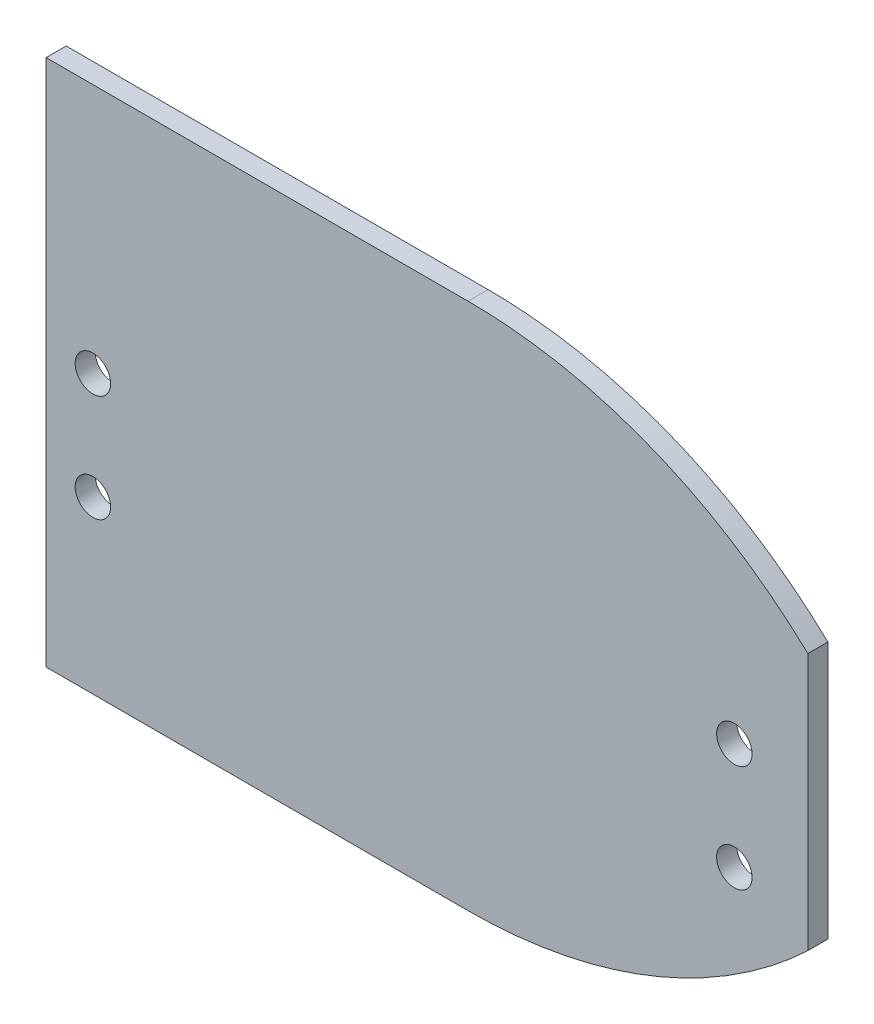
ISO-10303-21;
HEADER;
FILE_DESCRIPTION(('STEP AP214'),'2;1');
FILE_NAME('part.step','',(''),(''),'','','');
FILE_SCHEMA(('AUTOMOTIVE_DESIGN { 1 0 10303 214 1 1 1 1 }'));
ENDSEC;
DATA;
#1=APPLICATION_CONTEXT('core data for automotive mechanical design processes');
#2=APPLICATION_PROTOCOL_DEFINITION('international standard','automotive_design',2000,#1);
#3=PRODUCT_CONTEXT('',#1,'mechanical');
#4=PRODUCT('Part','Part','',(#3));
#5=PRODUCT_RELATED_PRODUCT_CATEGORY('part','',(#4));
#6=PRODUCT_DEFINITION_FORMATION('','',#4);
#7=PRODUCT_DEFINITION_CONTEXT('part definition',#1,'design');
#8=PRODUCT_DEFINITION('design','',#6,#7);
#9=PRODUCT_DEFINITION_SHAPE('','',#8);
#10=(LENGTH_UNIT() NAMED_UNIT(*) SI_UNIT(.MILLI.,.METRE.));
#11=(NAMED_UNIT(*) PLANE_ANGLE_UNIT() SI_UNIT($,.RADIAN.));
#12=(NAMED_UNIT(*) SI_UNIT($,.STERADIAN.) SOLID_ANGLE_UNIT());
#13=UNCERTAINTY_MEASURE_WITH_UNIT(LENGTH_MEASURE(1.E-05),#10,'distance_accuracy_value','');
#14=(GEOMETRIC_REPRESENTATION_CONTEXT(3) GLOBAL_UNCERTAINTY_ASSIGNED_CONTEXT((#13)) GLOBAL_UNIT_ASSIGNED_CONTEXT((#10,
#11,#12)) REPRESENTATION_CONTEXT('',''));
#15=CARTESIAN_POINT('',(0.,0.,0.));
#16=DIRECTION('',(0.,0.,1.));
#17=DIRECTION('',(1.,0.,0.));
#18=AXIS2_PLACEMENT_3D('',#15,#16,#17);
#19=CARTESIAN_POINT('',(223.609177450578,62.7062500000001,4.76250000000001));
#20=DIRECTION('',(0.,-1.,0.));
#21=DIRECTION('',(0.,0.,-1.));
#22=AXIS2_PLACEMENT_3D('',#19,#20,#21);
#23=PLANE('',#22);
#24=DIRECTION('',(-1.,0.,0.));
#25=VECTOR('',#24,1.);
#26=CARTESIAN_POINT('',(223.609177450578,62.7062500000001,0.));
#27=LINE('',#26,#25);
#28=CARTESIAN_POINT('',(323.85,62.7062500000001,0.));
#29=VERTEX_POINT('',#28);
#30=CARTESIAN_POINT('',(223.609177450578,62.7062500000001,0.));
#31=VERTEX_POINT('',#30);
#32=EDGE_CURVE('E94',#29,#31,#27,.T.);
#33=ORIENTED_EDGE('',*,*,#32,.T.);
#34=DIRECTION('',(0.,0.,-1.));
#35=VECTOR('',#34,1.);
#36=CARTESIAN_POINT('',(223.609177450578,62.7062500000001,4.76250000000001));
#37=LINE('',#36,#35);
#38=CARTESIAN_POINT('',(223.609177450578,62.7062500000001,4.76250000000001));
#39=VERTEX_POINT('',#38);
#40=EDGE_CURVE('E11',#39,#31,#37,.T.);
#41=ORIENTED_EDGE('',*,*,#40,.F.);
#42=DIRECTION('',(-1.,0.,0.));
#43=VECTOR('',#42,1.);
#44=CARTESIAN_POINT('',(223.609177450578,62.7062500000001,4.76250000000001));
#45=LINE('',#44,#43);
#46=CARTESIAN_POINT('',(323.85,62.7062500000001,4.76250000000001));
#47=VERTEX_POINT('',#46);
#48=EDGE_CURVE('E95',#47,#39,#45,.T.);
#49=ORIENTED_EDGE('',*,*,#48,.F.);
#50=DIRECTION('',(0.,0.,-1.));
#51=VECTOR('',#50,1.);
#52=CARTESIAN_POINT('',(323.85,62.7062500000001,4.76250000000001));
#53=LINE('',#52,#51);
#54=EDGE_CURVE('E125',#47,#29,#53,.T.);
#55=ORIENTED_EDGE('',*,*,#54,.T.);
#56=EDGE_LOOP('',(#33,#41,#49,#55));
#57=FACE_BOUND('',#56,.T.);
#58=ADVANCED_FACE('F24',(#57),#23,.F.);
#59=CARTESIAN_POINT('',(223.609177450578,62.7062500000001,4.76250000000001));
#60=DIRECTION('',(1.,0.,0.));
#61=DIRECTION('',(0.,1.,0.));
#62=AXIS2_PLACEMENT_3D('',#59,#60,#61);
#63=PLANE('',#62);
#64=DIRECTION('',(0.,-1.,0.));
#65=VECTOR('',#64,1.);
#66=CARTESIAN_POINT('',(223.609177450578,62.7062500000001,0.));
#67=LINE('',#66,#65);
#68=CARTESIAN_POINT('',(223.609177450578,-62.7062500000002,0.));
#69=VERTEX_POINT('',#68);
#70=EDGE_CURVE('E140',#31,#69,#67,.T.);
#71=ORIENTED_EDGE('',*,*,#70,.T.);
#72=DIRECTION('',(0.,0.,-1.));
#73=VECTOR('',#72,1.);
#74=CARTESIAN_POINT('',(223.609177450578,-62.7062500000002,4.76250000000001));
#75=LINE('',#74,#73);
#76=CARTESIAN_POINT('',(223.609177450578,-62.7062500000002,4.76250000000001));
#77=VERTEX_POINT('',#76);
#78=EDGE_CURVE('E31',#77,#69,#75,.T.);
#79=ORIENTED_EDGE('',*,*,#78,.F.);
#80=DIRECTION('',(0.,-1.,0.));
#81=VECTOR('',#80,1.);
#82=CARTESIAN_POINT('',(223.609177450578,62.7062500000001,4.76250000000001));
#83=LINE('',#82,#81);
#84=EDGE_CURVE('E98',#39,#77,#83,.T.);
#85=ORIENTED_EDGE('',*,*,#84,.F.);
#86=ORIENTED_EDGE('',*,*,#40,.T.);
#87=EDGE_LOOP('',(#71,#79,#85,#86));
#88=FACE_BOUND('',#87,.T.);
#89=ADVANCED_FACE('F175',(#88),#63,.F.);
#90=CARTESIAN_POINT('',(223.609177450578,-62.7062500000002,4.76250000000001));
#91=DIRECTION('',(0.,1.,0.));
#92=DIRECTION('',(-1.,0.,0.));
#93=AXIS2_PLACEMENT_3D('',#90,#91,#92);
#94=PLANE('',#93);
#95=DIRECTION('',(1.,0.,0.));
#96=VECTOR('',#95,1.);
#97=CARTESIAN_POINT('',(223.609177450578,-62.7062500000002,0.));
#98=LINE('',#97,#96);
#99=CARTESIAN_POINT('',(323.85,-62.7062500000002,0.));
#100=VERTEX_POINT('',#99);
#101=EDGE_CURVE('E100',#69,#100,#98,.T.);
#102=ORIENTED_EDGE('',*,*,#101,.T.);
#103=DIRECTION('',(0.,0.,-1.));
#104=VECTOR('',#103,1.);
#105=CARTESIAN_POINT('',(323.85,-62.7062500000002,4.76250000000001));
#106=LINE('',#105,#104);
#107=CARTESIAN_POINT('',(323.85,-62.7062500000002,4.76250000000001));
#108=VERTEX_POINT('',#107);
#109=EDGE_CURVE('E130',#108,#100,#106,.T.);
#110=ORIENTED_EDGE('',*,*,#109,.F.);
#111=DIRECTION('',(1.,0.,0.));
#112=VECTOR('',#111,1.);
#113=CARTESIAN_POINT('',(223.609177450578,-62.7062500000002,4.76250000000001));
#114=LINE('',#113,#112);
#115=EDGE_CURVE('E112',#77,#108,#114,.T.);
#116=ORIENTED_EDGE('',*,*,#115,.F.);
#117=ORIENTED_EDGE('',*,*,#78,.T.);
#118=EDGE_LOOP('',(#102,#110,#116,#117));
#119=FACE_BOUND('',#118,.T.);
#120=ADVANCED_FACE('F137',(#119),#94,.F.);
#121=CARTESIAN_POINT('',(323.85,54.7687500000002,4.76250000000001));
#122=DIRECTION('',(0.,0.,-1.));
#123=DIRECTION('',(-1.,0.,0.));
#124=AXIS2_PLACEMENT_3D('',#121,#122,#123);
#125=CYLINDRICAL_SURFACE('',#124,117.475);
#126=CARTESIAN_POINT('',(323.85,-62.7062500000002,0.));
#127=CARTESIAN_POINT('',(362.918256589753,-62.7062500000002,0.));
#128=CARTESIAN_POINT('',(397.580457592855,-44.68236322208,0.));
#129=CARTESIAN_POINT('',(420.018307661294,-12.7000000000009,0.));
#130=(BOUNDED_CURVE() B_SPLINE_CURVE(3,(#126,#127,#128,#129),.UNSPECIFIED.,.F.,
.F.) B_SPLINE_CURVE_WITH_KNOTS((4,4),(0.,1.),
.UNSPECIFIED.) CURVE() GEOMETRIC_REPRESENTATION_ITEM() RATIONAL_B_SPLINE_CURVE((1.,
0.924814397992086,0.924814397992086,1.)) REPRESENTATION_ITEM(''));
#131=CARTESIAN_POINT('',(404.583218646805,-30.5689499451429,0.));
#132=VERTEX_POINT('',#131);
#133=EDGE_CURVE('E96',#100,#132,#130,.T.);
#134=ORIENTED_EDGE('',*,*,#133,.T.);
#135=DIRECTION('',(0.,0.,-1.));
#136=VECTOR('',#135,1.);
#137=CARTESIAN_POINT('',(404.583218646805,-30.5689499451429,4.76250000000001));
#138=LINE('',#137,#136);
#139=CARTESIAN_POINT('',(404.583218646805,-30.5689499451429,4.76250000000001));
#140=VERTEX_POINT('',#139);
#141=EDGE_CURVE('E38',#140,#132,#138,.T.);
#142=ORIENTED_EDGE('',*,*,#141,.F.);
#143=CARTESIAN_POINT('',(323.85,-62.7062500000002,4.76250000000001));
#144=CARTESIAN_POINT('',(362.918256589753,-62.7062500000002,4.76250000000001));
#145=CARTESIAN_POINT('',(397.580457592855,-44.68236322208,4.76250000000001));
#146=CARTESIAN_POINT('',(420.018307661294,-12.7000000000009,4.76250000000001));
#147=(BOUNDED_CURVE() B_SPLINE_CURVE(3,(#143,#144,#145,#146),.UNSPECIFIED.,.F.,
.F.) B_SPLINE_CURVE_WITH_KNOTS((4,4),(0.,1.),
.UNSPECIFIED.) CURVE() GEOMETRIC_REPRESENTATION_ITEM() RATIONAL_B_SPLINE_CURVE((1.,
0.924814397992086,0.924814397992086,1.)) REPRESENTATION_ITEM(''));
#148=EDGE_CURVE('E114',#108,#140,#147,.T.);
#149=ORIENTED_EDGE('',*,*,#148,.F.);
#150=ORIENTED_EDGE('',*,*,#109,.T.);
#151=EDGE_LOOP('',(#134,#142,#149,#150));
#152=FACE_BOUND('',#151,.T.);
#153=ADVANCED_FACE('F170',(#152),#125,.T.);
#154=CARTESIAN_POINT('',(323.85,-54.76875,4.76250000000001));
#155=DIRECTION('',(0.,0.,-1.));
#156=DIRECTION('',(-1.,0.,0.));
#157=AXIS2_PLACEMENT_3D('',#154,#155,#156);
#158=CYLINDRICAL_SURFACE('',#157,117.475);
#159=CARTESIAN_POINT('',(420.018307661295,12.7000000000009,4.76250000000001));
#160=CARTESIAN_POINT('',(397.580457592855,44.6823632220799,4.76250000000001));
#161=CARTESIAN_POINT('',(362.918256589753,62.7062500000002,4.76250000000001));
#162=CARTESIAN_POINT('',(323.85,62.7062500000001,4.76250000000001));
#163=(BOUNDED_CURVE() B_SPLINE_CURVE(3,(#159,#160,#161,#162),.UNSPECIFIED.,.F.,
.F.) B_SPLINE_CURVE_WITH_KNOTS((4,4),(0.,1.),
.UNSPECIFIED.) CURVE() GEOMETRIC_REPRESENTATION_ITEM() RATIONAL_B_SPLINE_CURVE((1.,
0.924814397992086,0.924814397992086,1.)) REPRESENTATION_ITEM(''));
#164=CARTESIAN_POINT('',(404.583218646805,30.568949945143,4.76250000000001));
#165=VERTEX_POINT('',#164);
#166=EDGE_CURVE('E46',#165,#47,#163,.T.);
#167=ORIENTED_EDGE('',*,*,#166,.F.);
#168=DIRECTION('',(0.,0.,-1.));
#169=VECTOR('',#168,1.);
#170=CARTESIAN_POINT('',(404.583218646805,30.568949945143,4.76250000000001));
#171=LINE('',#170,#169);
#172=CARTESIAN_POINT('',(404.583218646805,30.568949945143,0.));
#173=VERTEX_POINT('',#172);
#174=EDGE_CURVE('E78',#173,#165,#171,.F.);
#175=ORIENTED_EDGE('',*,*,#174,.F.);
#176=CARTESIAN_POINT('',(420.018307661295,12.7000000000009,0.));
#177=CARTESIAN_POINT('',(397.580457592855,44.6823632220799,0.));
#178=CARTESIAN_POINT('',(362.918256589753,62.7062500000002,0.));
#179=CARTESIAN_POINT('',(323.85,62.7062500000001,0.));
#180=(BOUNDED_CURVE() B_SPLINE_CURVE(3,(#176,#177,#178,#179),.UNSPECIFIED.,.F.,
.F.) B_SPLINE_CURVE_WITH_KNOTS((4,4),(0.,1.),
.UNSPECIFIED.) CURVE() GEOMETRIC_REPRESENTATION_ITEM() RATIONAL_B_SPLINE_CURVE((1.,
0.924814397992086,0.924814397992086,1.)) REPRESENTATION_ITEM(''));
#181=EDGE_CURVE('E88',#173,#29,#180,.T.);
#182=ORIENTED_EDGE('',*,*,#181,.T.);
#183=ORIENTED_EDGE('',*,*,#54,.F.);
#184=EDGE_LOOP('',(#167,#175,#182,#183));
#185=FACE_BOUND('',#184,.T.);
#186=ADVANCED_FACE('F87',(#185),#158,.T.);
#187=CARTESIAN_POINT('',(378.046329297979,49.4576071061806,4.76250000000001));
#188=DIRECTION('',(0.,0.,1.));
#189=DIRECTION('',(1.,0.,0.));
#190=AXIS2_PLACEMENT_3D('',#187,#188,#189);
#191=PLANE('',#190);
#192=DIRECTION('',(0.,-1.,0.));
#193=VECTOR('',#192,1.);
#194=CARTESIAN_POINT('',(404.583218646805,79.288657817885,4.76250000000001));
#195=LINE('',#194,#193);
#196=EDGE_CURVE('E84',#165,#140,#195,.T.);
#197=ORIENTED_EDGE('',*,*,#196,.F.);
#198=ORIENTED_EDGE('',*,*,#166,.T.);
#199=ORIENTED_EDGE('',*,*,#48,.T.);
#200=ORIENTED_EDGE('',*,*,#84,.T.);
#201=ORIENTED_EDGE('',*,*,#115,.T.);
#202=ORIENTED_EDGE('',*,*,#148,.T.);
#203=EDGE_LOOP('',(#197,#198,#199,#200,#201,#202));
#204=FACE_BOUND('',#203,.T.);
#205=CARTESIAN_POINT('',(387.120718646805,3.25993371778287,4.76250000000001));
#206=DIRECTION('',(0.,0.,1.));
#207=DIRECTION('',(1.,0.,0.));
#208=AXIS2_PLACEMENT_3D('',#205,#206,#207);
#209=CIRCLE('',#208,4.21640000000001);
#210=CARTESIAN_POINT('',(391.337118646805,3.25993371778287,4.76250000000001));
#211=VERTEX_POINT('',#210);
#212=EDGE_CURVE('E83',#211,#211,#209,.T.);
#213=ORIENTED_EDGE('',*,*,#212,.F.);
#214=EDGE_LOOP('',(#213));
#215=FACE_BOUND('',#214,.T.);
#216=CARTESIAN_POINT('',(387.120718646805,-22.1400662822172,4.76250000000001));
#217=DIRECTION('',(0.,0.,1.));
#218=DIRECTION('',(1.,0.,0.));
#219=AXIS2_PLACEMENT_3D('',#216,#217,#218);
#220=CIRCLE('',#219,4.21640000000001);
#221=CARTESIAN_POINT('',(391.337118646805,-22.1400662822172,4.76250000000001));
#222=VERTEX_POINT('',#221);
#223=EDGE_CURVE('E159',#222,#222,#220,.T.);
#224=ORIENTED_EDGE('',*,*,#223,.F.);
#225=EDGE_LOOP('',(#224));
#226=FACE_BOUND('',#225,.T.);
#227=CARTESIAN_POINT('',(234.720718646805,-22.1400662822172,4.76250000000001));
#228=DIRECTION('',(0.,0.,1.));
#229=DIRECTION('',(1.,0.,0.));
#230=AXIS2_PLACEMENT_3D('',#227,#228,#229);
#231=CIRCLE('',#230,4.21639999999998);
#232=CARTESIAN_POINT('',(238.937118646805,-22.1400662822172,4.76250000000001));
#233=VERTEX_POINT('',#232);
#234=EDGE_CURVE('E153',#233,#233,#231,.T.);
#235=ORIENTED_EDGE('',*,*,#234,.F.);
#236=EDGE_LOOP('',(#235));
#237=FACE_BOUND('',#236,.T.);
#238=CARTESIAN_POINT('',(234.720718646805,3.25993371778286,4.76250000000001));
#239=DIRECTION('',(0.,0.,1.));
#240=DIRECTION('',(1.,0.,0.));
#241=AXIS2_PLACEMENT_3D('',#238,#239,#240);
#242=CIRCLE('',#241,4.21639999999998);
#243=CARTESIAN_POINT('',(238.937118646805,3.25993371778286,4.76250000000001));
#244=VERTEX_POINT('',#243);
#245=EDGE_CURVE('E147',#244,#244,#242,.T.);
#246=ORIENTED_EDGE('',*,*,#245,.F.);
#247=EDGE_LOOP('',(#246));
#248=FACE_BOUND('',#247,.T.);
#249=ADVANCED_FACE('F171',(#204,#215,#226,#237,#248),#191,.T.);
#250=CARTESIAN_POINT('',(378.046329297979,49.4576071061806,0.));
#251=DIRECTION('',(0.,0.,1.));
#252=DIRECTION('',(1.,0.,0.));
#253=AXIS2_PLACEMENT_3D('',#250,#251,#252);
#254=PLANE('',#253);
#255=CARTESIAN_POINT('',(387.120718646805,3.25993371778287,0.));
#256=DIRECTION('',(0.,0.,1.));
#257=DIRECTION('',(1.,0.,0.));
#258=AXIS2_PLACEMENT_3D('',#255,#256,#257);
#259=CIRCLE('',#258,4.21640000000001);
#260=CARTESIAN_POINT('',(391.337118646805,3.25993371778287,0.));
#261=VERTEX_POINT('',#260);
#262=EDGE_CURVE('E162',#261,#261,#259,.T.);
#263=ORIENTED_EDGE('',*,*,#262,.T.);
#264=EDGE_LOOP('',(#263));
#265=FACE_BOUND('',#264,.T.);
#266=CARTESIAN_POINT('',(387.120718646805,-22.1400662822172,0.));
#267=DIRECTION('',(0.,0.,1.));
#268=DIRECTION('',(1.,0.,0.));
#269=AXIS2_PLACEMENT_3D('',#266,#267,#268);
#270=CIRCLE('',#269,4.21640000000001);
#271=CARTESIAN_POINT('',(391.337118646805,-22.1400662822172,0.));
#272=VERTEX_POINT('',#271);
#273=EDGE_CURVE('E156',#272,#272,#270,.T.);
#274=ORIENTED_EDGE('',*,*,#273,.T.);
#275=EDGE_LOOP('',(#274));
#276=FACE_BOUND('',#275,.T.);
#277=CARTESIAN_POINT('',(234.720718646805,-22.1400662822172,0.));
#278=DIRECTION('',(0.,0.,1.));
#279=DIRECTION('',(1.,0.,0.));
#280=AXIS2_PLACEMENT_3D('',#277,#278,#279);
#281=CIRCLE('',#280,4.21639999999999);
#282=CARTESIAN_POINT('',(238.937118646805,-22.1400662822172,0.));
#283=VERTEX_POINT('',#282);
#284=EDGE_CURVE('E150',#283,#283,#281,.T.);
#285=ORIENTED_EDGE('',*,*,#284,.T.);
#286=EDGE_LOOP('',(#285));
#287=FACE_BOUND('',#286,.T.);
#288=CARTESIAN_POINT('',(234.720718646805,3.25993371778286,0.));
#289=DIRECTION('',(0.,0.,1.));
#290=DIRECTION('',(1.,0.,0.));
#291=AXIS2_PLACEMENT_3D('',#288,#289,#290);
#292=CIRCLE('',#291,4.21639999999999);
#293=CARTESIAN_POINT('',(238.937118646805,3.25993371778286,0.));
#294=VERTEX_POINT('',#293);
#295=EDGE_CURVE('E144',#294,#294,#292,.T.);
#296=ORIENTED_EDGE('',*,*,#295,.T.);
#297=EDGE_LOOP('',(#296));
#298=FACE_BOUND('',#297,.T.);
#299=ORIENTED_EDGE('',*,*,#181,.F.);
#300=DIRECTION('',(0.,1.,0.));
#301=VECTOR('',#300,1.);
#302=CARTESIAN_POINT('',(404.583218646805,79.288657817885,0.));
#303=LINE('',#302,#301);
#304=EDGE_CURVE('E75',#132,#173,#303,.T.);
#305=ORIENTED_EDGE('',*,*,#304,.F.);
#306=ORIENTED_EDGE('',*,*,#133,.F.);
#307=ORIENTED_EDGE('',*,*,#101,.F.);
#308=ORIENTED_EDGE('',*,*,#70,.F.);
#309=ORIENTED_EDGE('',*,*,#32,.F.);
#310=EDGE_LOOP('',(#299,#305,#306,#307,#308,#309));
#311=FACE_BOUND('',#310,.T.);
#312=ADVANCED_FACE('F92',(#265,#276,#287,#298,#311),#254,.F.);
#313=CARTESIAN_POINT('',(234.720718646805,3.25993371778286,4.76250000000001));
#314=DIRECTION('',(0.,0.,1.));
#315=DIRECTION('',(1.,0.,0.));
#316=AXIS2_PLACEMENT_3D('',#313,#314,#315);
#317=CYLINDRICAL_SURFACE('',#316,4.21639999999999);
#318=ORIENTED_EDGE('',*,*,#295,.F.);
#319=EDGE_LOOP('',(#318));
#320=FACE_BOUND('',#319,.T.);
#321=ORIENTED_EDGE('',*,*,#245,.T.);
#322=EDGE_LOOP('',(#321));
#323=FACE_BOUND('',#322,.T.);
#324=ADVANCED_FACE('F194',(#320,#323),#317,.F.);
#325=CARTESIAN_POINT('',(234.720718646805,-22.1400662822172,4.76250000000001));
#326=DIRECTION('',(0.,0.,1.));
#327=DIRECTION('',(1.,0.,0.));
#328=AXIS2_PLACEMENT_3D('',#325,#326,#327);
#329=CYLINDRICAL_SURFACE('',#328,4.21639999999999);
#330=ORIENTED_EDGE('',*,*,#284,.F.);
#331=EDGE_LOOP('',(#330));
#332=FACE_BOUND('',#331,.T.);
#333=ORIENTED_EDGE('',*,*,#234,.T.);
#334=EDGE_LOOP('',(#333));
#335=FACE_BOUND('',#334,.T.);
#336=ADVANCED_FACE('F198',(#332,#335),#329,.F.);
#337=CARTESIAN_POINT('',(387.120718646805,-22.1400662822172,4.76250000000001));
#338=DIRECTION('',(0.,0.,1.));
#339=DIRECTION('',(1.,0.,0.));
#340=AXIS2_PLACEMENT_3D('',#337,#338,#339);
#341=CYLINDRICAL_SURFACE('',#340,4.21640000000001);
#342=ORIENTED_EDGE('',*,*,#273,.F.);
#343=EDGE_LOOP('',(#342));
#344=FACE_BOUND('',#343,.T.);
#345=ORIENTED_EDGE('',*,*,#223,.T.);
#346=EDGE_LOOP('',(#345));
#347=FACE_BOUND('',#346,.T.);
#348=ADVANCED_FACE('F202',(#344,#347),#341,.F.);
#349=CARTESIAN_POINT('',(387.120718646805,3.25993371778287,4.76250000000001));
#350=DIRECTION('',(0.,0.,1.));
#351=DIRECTION('',(1.,0.,0.));
#352=AXIS2_PLACEMENT_3D('',#349,#350,#351);
#353=CYLINDRICAL_SURFACE('',#352,4.21640000000001);
#354=ORIENTED_EDGE('',*,*,#262,.F.);
#355=EDGE_LOOP('',(#354));
#356=FACE_BOUND('',#355,.T.);
#357=ORIENTED_EDGE('',*,*,#212,.T.);
#358=EDGE_LOOP('',(#357));
#359=FACE_BOUND('',#358,.T.);
#360=ADVANCED_FACE('F206',(#356,#359),#353,.F.);
#361=CARTESIAN_POINT('',(404.583218646805,79.288657817885,-0.00100000000000013));
#362=DIRECTION('',(-1.,0.,0.));
#363=DIRECTION('',(0.,0.,1.));
#364=AXIS2_PLACEMENT_3D('',#361,#362,#363);
#365=PLANE('',#364);
#366=ORIENTED_EDGE('',*,*,#141,.T.);
#367=ORIENTED_EDGE('',*,*,#304,.T.);
#368=ORIENTED_EDGE('',*,*,#174,.T.);
#369=ORIENTED_EDGE('',*,*,#196,.T.);
#370=EDGE_LOOP('',(#366,#367,#368,#369));
#371=FACE_BOUND('',#370,.T.);
#372=ADVANCED_FACE('F77',(#371),#365,.F.);
#373=CLOSED_SHELL('',(#58,#89,#120,#153,#186,#249,#312,#324,#336,#348,#360,#372));
#374=MANIFOLD_SOLID_BREP('B2',#373);
#375=ADVANCED_BREP_SHAPE_REPRESENTATION('',(#18,#374),#14);
#376=SHAPE_DEFINITION_REPRESENTATION(#9,#375);
ENDSEC;
END-ISO-10303-21;
